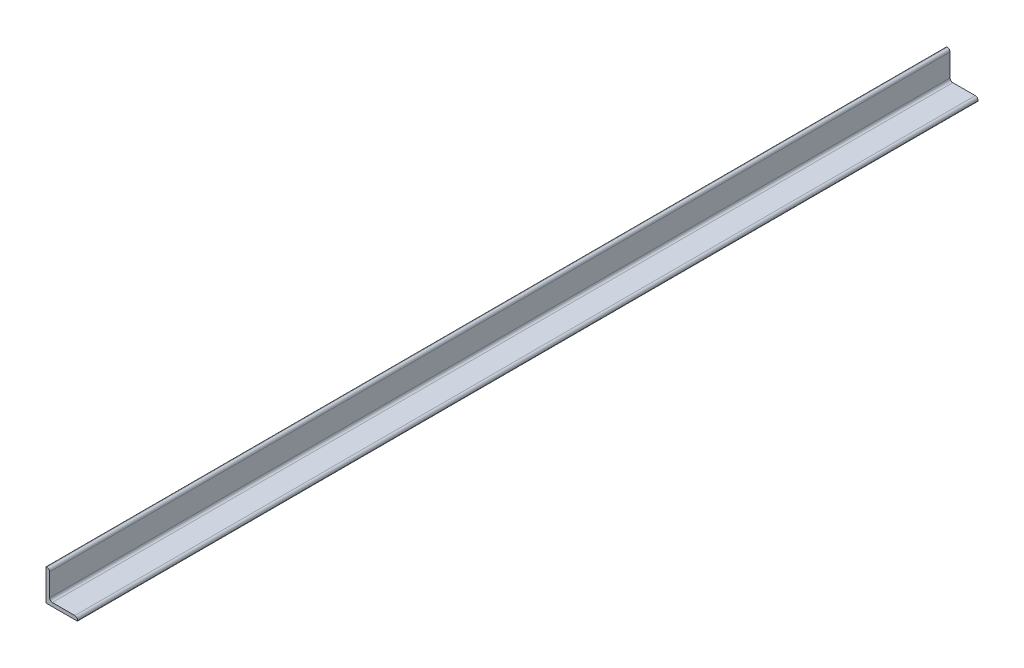
ISO-10303-21;
HEADER;
FILE_DESCRIPTION(('STEP AP214'),'2;1');
FILE_NAME('part.step','',(''),(''),'','','');
FILE_SCHEMA(('AUTOMOTIVE_DESIGN { 1 0 10303 214 1 1 1 1 }'));
ENDSEC;
DATA;
#1=APPLICATION_CONTEXT('core data for automotive mechanical design processes');
#2=APPLICATION_PROTOCOL_DEFINITION('international standard','automotive_design',2000,#1);
#3=PRODUCT_CONTEXT('',#1,'mechanical');
#4=PRODUCT('Part','Part','',(#3));
#5=PRODUCT_RELATED_PRODUCT_CATEGORY('part','',(#4));
#6=PRODUCT_DEFINITION_FORMATION('','',#4);
#7=PRODUCT_DEFINITION_CONTEXT('part definition',#1,'design');
#8=PRODUCT_DEFINITION('design','',#6,#7);
#9=PRODUCT_DEFINITION_SHAPE('','',#8);
#10=(LENGTH_UNIT() NAMED_UNIT(*) SI_UNIT(.MILLI.,.METRE.));
#11=(NAMED_UNIT(*) PLANE_ANGLE_UNIT() SI_UNIT($,.RADIAN.));
#12=(NAMED_UNIT(*) SI_UNIT($,.STERADIAN.) SOLID_ANGLE_UNIT());
#13=UNCERTAINTY_MEASURE_WITH_UNIT(LENGTH_MEASURE(1.E-05),#10,'distance_accuracy_value','');
#14=(GEOMETRIC_REPRESENTATION_CONTEXT(3) GLOBAL_UNCERTAINTY_ASSIGNED_CONTEXT((#13)) GLOBAL_UNIT_ASSIGNED_CONTEXT((#10,
#11,#12)) REPRESENTATION_CONTEXT('',''));
#15=CARTESIAN_POINT('',(0.,0.,0.));
#16=DIRECTION('',(0.,0.,1.));
#17=DIRECTION('',(1.,0.,0.));
#18=AXIS2_PLACEMENT_3D('',#15,#16,#17);
#19=CARTESIAN_POINT('',(35.,4.,1000.));
#20=DIRECTION('',(0.,-1.,0.));
#21=DIRECTION('',(1.,0.,0.));
#22=AXIS2_PLACEMENT_3D('',#19,#20,#21);
#23=PLANE('',#22);
#24=DIRECTION('',(-1.,0.,0.));
#25=VECTOR('',#24,1.);
#26=CARTESIAN_POINT('',(35.,4.,1000.));
#27=LINE('',#26,#25);
#28=CARTESIAN_POINT('',(32.,4.,1000.));
#29=VERTEX_POINT('',#28);
#30=CARTESIAN_POINT('',(7.,4.,1000.));
#31=VERTEX_POINT('',#30);
#32=EDGE_CURVE('E132',#29,#31,#27,.T.);
#33=ORIENTED_EDGE('',*,*,#32,.F.);
#34=DIRECTION('',(0.,0.,-1.));
#35=VECTOR('',#34,1.);
#36=CARTESIAN_POINT('',(32.,4.,1000.));
#37=LINE('',#36,#35);
#38=CARTESIAN_POINT('',(32.,4.,0.));
#39=VERTEX_POINT('',#38);
#40=EDGE_CURVE('E176',#29,#39,#37,.T.);
#41=ORIENTED_EDGE('',*,*,#40,.T.);
#42=DIRECTION('',(-1.,0.,0.));
#43=VECTOR('',#42,1.);
#44=CARTESIAN_POINT('',(35.,4.,0.));
#45=LINE('',#44,#43);
#46=CARTESIAN_POINT('',(7.,4.,0.));
#47=VERTEX_POINT('',#46);
#48=EDGE_CURVE('E181',#39,#47,#45,.T.);
#49=ORIENTED_EDGE('',*,*,#48,.T.);
#50=DIRECTION('',(0.,0.,-1.));
#51=VECTOR('',#50,1.);
#52=CARTESIAN_POINT('',(7.,4.,1000.));
#53=LINE('',#52,#51);
#54=EDGE_CURVE('E31',#47,#31,#53,.F.);
#55=ORIENTED_EDGE('',*,*,#54,.T.);
#56=EDGE_LOOP('',(#33,#41,#49,#55));
#57=FACE_BOUND('',#56,.T.);
#58=ADVANCED_FACE('F16',(#57),#23,.F.);
#59=CARTESIAN_POINT('',(4.,4.,1000.));
#60=DIRECTION('',(-1.,0.,0.));
#61=DIRECTION('',(0.,-1.,0.));
#62=AXIS2_PLACEMENT_3D('',#59,#60,#61);
#63=PLANE('',#62);
#64=DIRECTION('',(0.,1.,0.));
#65=VECTOR('',#64,1.);
#66=CARTESIAN_POINT('',(4.,4.,0.));
#67=LINE('',#66,#65);
#68=CARTESIAN_POINT('',(4.,7.,0.));
#69=VERTEX_POINT('',#68);
#70=CARTESIAN_POINT('',(4.,32.,0.));
#71=VERTEX_POINT('',#70);
#72=EDGE_CURVE('E183',#69,#71,#67,.T.);
#73=ORIENTED_EDGE('',*,*,#72,.T.);
#74=DIRECTION('',(0.,0.,-1.));
#75=VECTOR('',#74,1.);
#76=CARTESIAN_POINT('',(4.,32.,1000.));
#77=LINE('',#76,#75);
#78=CARTESIAN_POINT('',(4.,32.,1000.));
#79=VERTEX_POINT('',#78);
#80=EDGE_CURVE('E170',#71,#79,#77,.F.);
#81=ORIENTED_EDGE('',*,*,#80,.T.);
#82=DIRECTION('',(0.,1.,0.));
#83=VECTOR('',#82,1.);
#84=CARTESIAN_POINT('',(4.,4.,1000.));
#85=LINE('',#84,#83);
#86=CARTESIAN_POINT('',(4.,7.,1000.));
#87=VERTEX_POINT('',#86);
#88=EDGE_CURVE('E135',#87,#79,#85,.T.);
#89=ORIENTED_EDGE('',*,*,#88,.F.);
#90=DIRECTION('',(0.,0.,-1.));
#91=VECTOR('',#90,1.);
#92=CARTESIAN_POINT('',(4.,7.,0.));
#93=LINE('',#92,#91);
#94=EDGE_CURVE('E167',#87,#69,#93,.T.);
#95=ORIENTED_EDGE('',*,*,#94,.T.);
#96=EDGE_LOOP('',(#73,#81,#89,#95));
#97=FACE_BOUND('',#96,.T.);
#98=ADVANCED_FACE('F194',(#97),#63,.F.);
#99=CARTESIAN_POINT('',(4.,35.,1000.));
#100=DIRECTION('',(0.,-1.,0.));
#101=DIRECTION('',(0.,0.,-1.));
#102=AXIS2_PLACEMENT_3D('',#99,#100,#101);
#103=PLANE('',#102);
#104=DIRECTION('',(-1.,0.,0.));
#105=VECTOR('',#104,1.);
#106=CARTESIAN_POINT('',(4.,35.,1000.));
#107=LINE('',#106,#105);
#108=CARTESIAN_POINT('',(1.,35.,1000.));
#109=VERTEX_POINT('',#108);
#110=CARTESIAN_POINT('',(0.3,35.,1000.));
#111=VERTEX_POINT('',#110);
#112=EDGE_CURVE('E196',#109,#111,#107,.T.);
#113=ORIENTED_EDGE('',*,*,#112,.F.);
#114=DIRECTION('',(0.,0.,-1.));
#115=VECTOR('',#114,1.);
#116=CARTESIAN_POINT('',(1.,35.,1000.));
#117=LINE('',#116,#115);
#118=CARTESIAN_POINT('',(1.,35.,0.));
#119=VERTEX_POINT('',#118);
#120=EDGE_CURVE('E161',#109,#119,#117,.T.);
#121=ORIENTED_EDGE('',*,*,#120,.T.);
#122=DIRECTION('',(-1.,0.,0.));
#123=VECTOR('',#122,1.);
#124=CARTESIAN_POINT('',(4.,35.,0.));
#125=LINE('',#124,#123);
#126=CARTESIAN_POINT('',(0.3,35.,0.));
#127=VERTEX_POINT('',#126);
#128=EDGE_CURVE('E208',#119,#127,#125,.T.);
#129=ORIENTED_EDGE('',*,*,#128,.T.);
#130=DIRECTION('',(0.,0.,-1.));
#131=VECTOR('',#130,1.);
#132=CARTESIAN_POINT('',(0.3,35.,1000.));
#133=LINE('',#132,#131);
#134=EDGE_CURVE('E158',#127,#111,#133,.F.);
#135=ORIENTED_EDGE('',*,*,#134,.T.);
#136=EDGE_LOOP('',(#113,#121,#129,#135));
#137=FACE_BOUND('',#136,.T.);
#138=ADVANCED_FACE('F231',(#137),#103,.F.);
#139=CARTESIAN_POINT('',(0.,35.,1000.));
#140=DIRECTION('',(1.,0.,0.));
#141=DIRECTION('',(0.,1.,0.));
#142=AXIS2_PLACEMENT_3D('',#139,#140,#141);
#143=PLANE('',#142);
#144=DIRECTION('',(0.,-1.,0.));
#145=VECTOR('',#144,1.);
#146=CARTESIAN_POINT('',(0.,35.,1000.));
#147=LINE('',#146,#145);
#148=CARTESIAN_POINT('',(0.,34.7,1000.));
#149=VERTEX_POINT('',#148);
#150=CARTESIAN_POINT('',(0.,0.300000000000002,1000.));
#151=VERTEX_POINT('',#150);
#152=EDGE_CURVE('E198',#149,#151,#147,.T.);
#153=ORIENTED_EDGE('',*,*,#152,.F.);
#154=DIRECTION('',(0.,0.,-1.));
#155=VECTOR('',#154,1.);
#156=CARTESIAN_POINT('',(0.,34.7,1000.));
#157=LINE('',#156,#155);
#158=CARTESIAN_POINT('',(0.,34.7,0.));
#159=VERTEX_POINT('',#158);
#160=EDGE_CURVE('E155',#149,#159,#157,.T.);
#161=ORIENTED_EDGE('',*,*,#160,.T.);
#162=DIRECTION('',(0.,-1.,0.));
#163=VECTOR('',#162,1.);
#164=CARTESIAN_POINT('',(0.,35.,0.));
#165=LINE('',#164,#163);
#166=CARTESIAN_POINT('',(0.,0.300000000000002,0.));
#167=VERTEX_POINT('',#166);
#168=EDGE_CURVE('E137',#159,#167,#165,.T.);
#169=ORIENTED_EDGE('',*,*,#168,.T.);
#170=DIRECTION('',(0.,0.,-1.));
#171=VECTOR('',#170,1.);
#172=CARTESIAN_POINT('',(0.,0.300000000000002,1000.));
#173=LINE('',#172,#171);
#174=EDGE_CURVE('E153',#167,#151,#173,.F.);
#175=ORIENTED_EDGE('',*,*,#174,.T.);
#176=EDGE_LOOP('',(#153,#161,#169,#175));
#177=FACE_BOUND('',#176,.T.);
#178=ADVANCED_FACE('F214',(#177),#143,.F.);
#179=CARTESIAN_POINT('',(0.,0.,1000.));
#180=DIRECTION('',(0.,1.,0.));
#181=DIRECTION('',(0.,0.,1.));
#182=AXIS2_PLACEMENT_3D('',#179,#180,#181);
#183=PLANE('',#182);
#184=DIRECTION('',(1.,0.,0.));
#185=VECTOR('',#184,1.);
#186=CARTESIAN_POINT('',(0.,0.,0.));
#187=LINE('',#186,#185);
#188=CARTESIAN_POINT('',(0.3,0.,0.));
#189=VERTEX_POINT('',#188);
#190=CARTESIAN_POINT('',(34.7,0.,0.));
#191=VERTEX_POINT('',#190);
#192=EDGE_CURVE('E133',#189,#191,#187,.T.);
#193=ORIENTED_EDGE('',*,*,#192,.T.);
#194=DIRECTION('',(0.,0.,-1.));
#195=VECTOR('',#194,1.);
#196=CARTESIAN_POINT('',(34.7,0.,1000.));
#197=LINE('',#196,#195);
#198=CARTESIAN_POINT('',(34.7,0.,1000.));
#199=VERTEX_POINT('',#198);
#200=EDGE_CURVE('E111',#191,#199,#197,.F.);
#201=ORIENTED_EDGE('',*,*,#200,.T.);
#202=DIRECTION('',(1.,0.,0.));
#203=VECTOR('',#202,1.);
#204=CARTESIAN_POINT('',(0.,0.,1000.));
#205=LINE('',#204,#203);
#206=CARTESIAN_POINT('',(0.3,0.,1000.));
#207=VERTEX_POINT('',#206);
#208=EDGE_CURVE('E203',#207,#199,#205,.T.);
#209=ORIENTED_EDGE('',*,*,#208,.F.);
#210=DIRECTION('',(0.,0.,-1.));
#211=VECTOR('',#210,1.);
#212=CARTESIAN_POINT('',(0.3,0.,1000.));
#213=LINE('',#212,#211);
#214=EDGE_CURVE('E116',#207,#189,#213,.T.);
#215=ORIENTED_EDGE('',*,*,#214,.T.);
#216=EDGE_LOOP('',(#193,#201,#209,#215));
#217=FACE_BOUND('',#216,.T.);
#218=ADVANCED_FACE('F222',(#217),#183,.F.);
#219=CARTESIAN_POINT('',(35.,0.,1000.));
#220=DIRECTION('',(-1.,0.,0.));
#221=DIRECTION('',(0.,0.,1.));
#222=AXIS2_PLACEMENT_3D('',#219,#220,#221);
#223=PLANE('',#222);
#224=DIRECTION('',(0.,1.,0.));
#225=VECTOR('',#224,1.);
#226=CARTESIAN_POINT('',(35.,0.,0.));
#227=LINE('',#226,#225);
#228=CARTESIAN_POINT('',(35.,0.3,0.));
#229=VERTEX_POINT('',#228);
#230=CARTESIAN_POINT('',(35.,0.999999999999996,0.));
#231=VERTEX_POINT('',#230);
#232=EDGE_CURVE('E123',#229,#231,#227,.T.);
#233=ORIENTED_EDGE('',*,*,#232,.T.);
#234=DIRECTION('',(0.,0.,-1.));
#235=VECTOR('',#234,1.);
#236=CARTESIAN_POINT('',(35.,0.999999999999996,1000.));
#237=LINE('',#236,#235);
#238=CARTESIAN_POINT('',(35.,0.999999999999996,1000.));
#239=VERTEX_POINT('',#238);
#240=EDGE_CURVE('E179',#231,#239,#237,.F.);
#241=ORIENTED_EDGE('',*,*,#240,.T.);
#242=DIRECTION('',(0.,1.,0.));
#243=VECTOR('',#242,1.);
#244=CARTESIAN_POINT('',(35.,0.,1000.));
#245=LINE('',#244,#243);
#246=CARTESIAN_POINT('',(35.,0.3,1000.));
#247=VERTEX_POINT('',#246);
#248=EDGE_CURVE('E125',#247,#239,#245,.T.);
#249=ORIENTED_EDGE('',*,*,#248,.F.);
#250=DIRECTION('',(0.,0.,-1.));
#251=VECTOR('',#250,1.);
#252=CARTESIAN_POINT('',(35.,0.3,1000.));
#253=LINE('',#252,#251);
#254=EDGE_CURVE('E110',#247,#229,#253,.T.);
#255=ORIENTED_EDGE('',*,*,#254,.T.);
#256=EDGE_LOOP('',(#233,#241,#249,#255));
#257=FACE_BOUND('',#256,.T.);
#258=ADVANCED_FACE('F122',(#257),#223,.F.);
#259=CARTESIAN_POINT('',(0.,0.,1000.));
#260=DIRECTION('',(0.,0.,-1.));
#261=DIRECTION('',(-1.,0.,0.));
#262=AXIS2_PLACEMENT_3D('',#259,#260,#261);
#263=PLANE('',#262);
#264=ORIENTED_EDGE('',*,*,#88,.T.);
#265=CARTESIAN_POINT('',(1.,32.,1000.));
#266=DIRECTION('',(0.,0.,-1.));
#267=DIRECTION('',(-1.,0.,0.));
#268=AXIS2_PLACEMENT_3D('',#265,#266,#267);
#269=CIRCLE('',#268,3.);
#270=EDGE_CURVE('E173',#79,#109,#269,.F.);
#271=ORIENTED_EDGE('',*,*,#270,.T.);
#272=ORIENTED_EDGE('',*,*,#112,.T.);
#273=CARTESIAN_POINT('',(0.3,34.7,1000.));
#274=DIRECTION('',(0.,0.,-1.));
#275=DIRECTION('',(-1.,0.,0.));
#276=AXIS2_PLACEMENT_3D('',#273,#274,#275);
#277=CIRCLE('',#276,0.3);
#278=EDGE_CURVE('E149',#111,#149,#277,.F.);
#279=ORIENTED_EDGE('',*,*,#278,.T.);
#280=ORIENTED_EDGE('',*,*,#152,.T.);
#281=CARTESIAN_POINT('',(0.3,0.3,1000.));
#282=DIRECTION('',(0.,0.,-1.));
#283=DIRECTION('',(-1.,0.,0.));
#284=AXIS2_PLACEMENT_3D('',#281,#282,#283);
#285=CIRCLE('',#284,0.3);
#286=EDGE_CURVE('E147',#151,#207,#285,.F.);
#287=ORIENTED_EDGE('',*,*,#286,.T.);
#288=ORIENTED_EDGE('',*,*,#208,.T.);
#289=CARTESIAN_POINT('',(34.7,0.3,1000.));
#290=DIRECTION('',(0.,0.,-1.));
#291=DIRECTION('',(-1.,0.,0.));
#292=AXIS2_PLACEMENT_3D('',#289,#290,#291);
#293=CIRCLE('',#292,0.3);
#294=EDGE_CURVE('E151',#199,#247,#293,.F.);
#295=ORIENTED_EDGE('',*,*,#294,.T.);
#296=ORIENTED_EDGE('',*,*,#248,.T.);
#297=CARTESIAN_POINT('',(32.,0.999999999999996,1000.));
#298=DIRECTION('',(0.,0.,-1.));
#299=DIRECTION('',(-1.,0.,0.));
#300=AXIS2_PLACEMENT_3D('',#297,#298,#299);
#301=CIRCLE('',#300,3.);
#302=EDGE_CURVE('E38',#239,#29,#301,.F.);
#303=ORIENTED_EDGE('',*,*,#302,.T.);
#304=ORIENTED_EDGE('',*,*,#32,.T.);
#305=CARTESIAN_POINT('',(7.,7.,1000.));
#306=DIRECTION('',(0.,0.,-1.));
#307=DIRECTION('',(-1.,0.,0.));
#308=AXIS2_PLACEMENT_3D('',#305,#306,#307);
#309=CIRCLE('',#308,3.);
#310=EDGE_CURVE('E10',#31,#87,#309,.T.);
#311=ORIENTED_EDGE('',*,*,#310,.T.);
#312=EDGE_LOOP('',(#264,#271,#272,#279,#280,#287,#288,#295,#296,#303,#304,#311));
#313=FACE_BOUND('',#312,.T.);
#314=ADVANCED_FACE('F191',(#313),#263,.F.);
#315=CARTESIAN_POINT('',(0.,0.,0.));
#316=DIRECTION('',(0.,0.,-1.));
#317=DIRECTION('',(-1.,0.,0.));
#318=AXIS2_PLACEMENT_3D('',#315,#316,#317);
#319=PLANE('',#318);
#320=ORIENTED_EDGE('',*,*,#128,.F.);
#321=CARTESIAN_POINT('',(1.,32.,0.));
#322=DIRECTION('',(0.,0.,-1.));
#323=DIRECTION('',(-1.,0.,0.));
#324=AXIS2_PLACEMENT_3D('',#321,#322,#323);
#325=CIRCLE('',#324,3.);
#326=EDGE_CURVE('E165',#119,#71,#325,.T.);
#327=ORIENTED_EDGE('',*,*,#326,.T.);
#328=ORIENTED_EDGE('',*,*,#72,.F.);
#329=CARTESIAN_POINT('',(7.,7.,0.));
#330=DIRECTION('',(0.,0.,-1.));
#331=DIRECTION('',(-1.,0.,0.));
#332=AXIS2_PLACEMENT_3D('',#329,#330,#331);
#333=CIRCLE('',#332,3.);
#334=EDGE_CURVE('E24',#69,#47,#333,.F.);
#335=ORIENTED_EDGE('',*,*,#334,.T.);
#336=ORIENTED_EDGE('',*,*,#48,.F.);
#337=CARTESIAN_POINT('',(32.,0.999999999999996,0.));
#338=DIRECTION('',(0.,0.,-1.));
#339=DIRECTION('',(-1.,0.,0.));
#340=AXIS2_PLACEMENT_3D('',#337,#338,#339);
#341=CIRCLE('',#340,3.);
#342=EDGE_CURVE('E131',#39,#231,#341,.T.);
#343=ORIENTED_EDGE('',*,*,#342,.T.);
#344=ORIENTED_EDGE('',*,*,#232,.F.);
#345=CARTESIAN_POINT('',(34.7,0.3,0.));
#346=DIRECTION('',(0.,0.,-1.));
#347=DIRECTION('',(-1.,0.,0.));
#348=AXIS2_PLACEMENT_3D('',#345,#346,#347);
#349=CIRCLE('',#348,0.3);
#350=EDGE_CURVE('E106',#229,#191,#349,.T.);
#351=ORIENTED_EDGE('',*,*,#350,.T.);
#352=ORIENTED_EDGE('',*,*,#192,.F.);
#353=CARTESIAN_POINT('',(0.3,0.3,0.));
#354=DIRECTION('',(0.,0.,-1.));
#355=DIRECTION('',(-1.,0.,0.));
#356=AXIS2_PLACEMENT_3D('',#353,#354,#355);
#357=CIRCLE('',#356,0.3);
#358=EDGE_CURVE('E126',#189,#167,#357,.T.);
#359=ORIENTED_EDGE('',*,*,#358,.T.);
#360=ORIENTED_EDGE('',*,*,#168,.F.);
#361=CARTESIAN_POINT('',(0.3,34.7,0.));
#362=DIRECTION('',(0.,0.,-1.));
#363=DIRECTION('',(-1.,0.,0.));
#364=AXIS2_PLACEMENT_3D('',#361,#362,#363);
#365=CIRCLE('',#364,0.3);
#366=EDGE_CURVE('E117',#159,#127,#365,.T.);
#367=ORIENTED_EDGE('',*,*,#366,.T.);
#368=EDGE_LOOP('',(#320,#327,#328,#335,#336,#343,#344,#351,#352,#359,#360,#367));
#369=FACE_BOUND('',#368,.T.);
#370=ADVANCED_FACE('F129',(#369),#319,.T.);
#371=CARTESIAN_POINT('',(34.7,0.3,1000.));
#372=DIRECTION('',(0.,0.,-1.));
#373=DIRECTION('',(-1.,0.,0.));
#374=AXIS2_PLACEMENT_3D('',#371,#372,#373);
#375=CYLINDRICAL_SURFACE('',#374,0.3);
#376=ORIENTED_EDGE('',*,*,#294,.F.);
#377=ORIENTED_EDGE('',*,*,#200,.F.);
#378=ORIENTED_EDGE('',*,*,#350,.F.);
#379=ORIENTED_EDGE('',*,*,#254,.F.);
#380=EDGE_LOOP('',(#376,#377,#378,#379));
#381=FACE_BOUND('',#380,.T.);
#382=ADVANCED_FACE('F109',(#381),#375,.T.);
#383=CARTESIAN_POINT('',(0.3,34.7,1000.));
#384=DIRECTION('',(0.,0.,-1.));
#385=DIRECTION('',(-1.,0.,0.));
#386=AXIS2_PLACEMENT_3D('',#383,#384,#385);
#387=CYLINDRICAL_SURFACE('',#386,0.3);
#388=ORIENTED_EDGE('',*,*,#278,.F.);
#389=ORIENTED_EDGE('',*,*,#134,.F.);
#390=ORIENTED_EDGE('',*,*,#366,.F.);
#391=ORIENTED_EDGE('',*,*,#160,.F.);
#392=EDGE_LOOP('',(#388,#389,#390,#391));
#393=FACE_BOUND('',#392,.T.);
#394=ADVANCED_FACE('F243',(#393),#387,.T.);
#395=CARTESIAN_POINT('',(0.3,0.3,1000.));
#396=DIRECTION('',(0.,0.,-1.));
#397=DIRECTION('',(-1.,0.,0.));
#398=AXIS2_PLACEMENT_3D('',#395,#396,#397);
#399=CYLINDRICAL_SURFACE('',#398,0.3);
#400=ORIENTED_EDGE('',*,*,#286,.F.);
#401=ORIENTED_EDGE('',*,*,#174,.F.);
#402=ORIENTED_EDGE('',*,*,#358,.F.);
#403=ORIENTED_EDGE('',*,*,#214,.F.);
#404=EDGE_LOOP('',(#400,#401,#402,#403));
#405=FACE_BOUND('',#404,.T.);
#406=ADVANCED_FACE('F218',(#405),#399,.T.);
#407=CARTESIAN_POINT('',(1.,32.,1000.));
#408=DIRECTION('',(0.,0.,-1.));
#409=DIRECTION('',(-1.,0.,0.));
#410=AXIS2_PLACEMENT_3D('',#407,#408,#409);
#411=CYLINDRICAL_SURFACE('',#410,3.);
#412=ORIENTED_EDGE('',*,*,#270,.F.);
#413=ORIENTED_EDGE('',*,*,#80,.F.);
#414=ORIENTED_EDGE('',*,*,#326,.F.);
#415=ORIENTED_EDGE('',*,*,#120,.F.);
#416=EDGE_LOOP('',(#412,#413,#414,#415));
#417=FACE_BOUND('',#416,.T.);
#418=ADVANCED_FACE('F249',(#417),#411,.T.);
#419=CARTESIAN_POINT('',(32.,0.999999999999996,1000.));
#420=DIRECTION('',(0.,0.,-1.));
#421=DIRECTION('',(-1.,0.,0.));
#422=AXIS2_PLACEMENT_3D('',#419,#420,#421);
#423=CYLINDRICAL_SURFACE('',#422,3.);
#424=ORIENTED_EDGE('',*,*,#302,.F.);
#425=ORIENTED_EDGE('',*,*,#240,.F.);
#426=ORIENTED_EDGE('',*,*,#342,.F.);
#427=ORIENTED_EDGE('',*,*,#40,.F.);
#428=EDGE_LOOP('',(#424,#425,#426,#427));
#429=FACE_BOUND('',#428,.T.);
#430=ADVANCED_FACE('F251',(#429),#423,.T.);
#431=CARTESIAN_POINT('',(7.,7.,1000.));
#432=DIRECTION('',(0.,0.,1.));
#433=DIRECTION('',(1.,0.,0.));
#434=AXIS2_PLACEMENT_3D('',#431,#432,#433);
#435=CYLINDRICAL_SURFACE('',#434,3.);
#436=ORIENTED_EDGE('',*,*,#310,.F.);
#437=ORIENTED_EDGE('',*,*,#54,.F.);
#438=ORIENTED_EDGE('',*,*,#334,.F.);
#439=ORIENTED_EDGE('',*,*,#94,.F.);
#440=EDGE_LOOP('',(#436,#437,#438,#439));
#441=FACE_BOUND('',#440,.T.);
#442=ADVANCED_FACE('F18',(#441),#435,.F.);
#443=CLOSED_SHELL('',(#58,#98,#138,#178,#218,#258,#314,#370,#382,#394,#406,#418,#430,#442));
#444=MANIFOLD_SOLID_BREP('B1',#443);
#445=ADVANCED_BREP_SHAPE_REPRESENTATION('',(#18,#444),#14);
#446=SHAPE_DEFINITION_REPRESENTATION(#9,#445);
ENDSEC;
END-ISO-10303-21;
